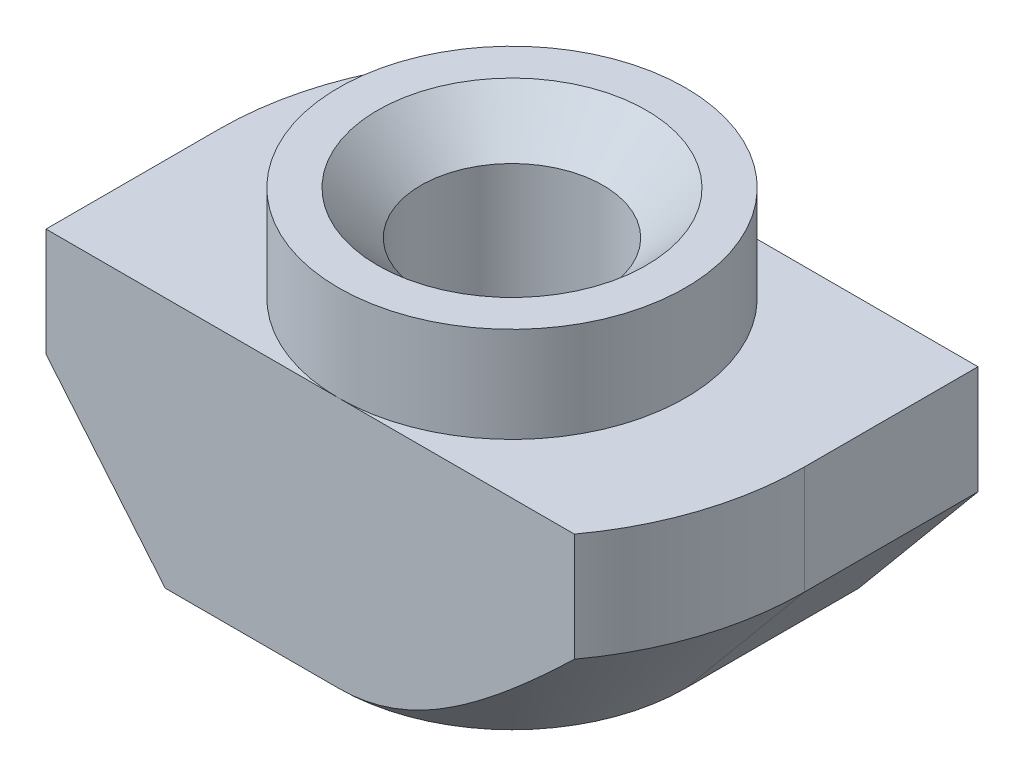
ISO-10303-21;
HEADER;
FILE_DESCRIPTION(('STEP AP214'),'2;1');
FILE_NAME('part.step','',(''),(''),'','','');
FILE_SCHEMA(('AUTOMOTIVE_DESIGN { 1 0 10303 214 1 1 1 1 }'));
ENDSEC;
DATA;
#1=APPLICATION_CONTEXT('core data for automotive mechanical design processes');
#2=APPLICATION_PROTOCOL_DEFINITION('international standard','automotive_design',2000,#1);
#3=PRODUCT_CONTEXT('',#1,'mechanical');
#4=PRODUCT('Part','Part','',(#3));
#5=PRODUCT_RELATED_PRODUCT_CATEGORY('part','',(#4));
#6=PRODUCT_DEFINITION_FORMATION('','',#4);
#7=PRODUCT_DEFINITION_CONTEXT('part definition',#1,'design');
#8=PRODUCT_DEFINITION('design','',#6,#7);
#9=PRODUCT_DEFINITION_SHAPE('','',#8);
#10=(LENGTH_UNIT() NAMED_UNIT(*) SI_UNIT(.MILLI.,.METRE.));
#11=(NAMED_UNIT(*) PLANE_ANGLE_UNIT() SI_UNIT($,.RADIAN.));
#12=(NAMED_UNIT(*) SI_UNIT($,.STERADIAN.) SOLID_ANGLE_UNIT());
#13=UNCERTAINTY_MEASURE_WITH_UNIT(LENGTH_MEASURE(1.E-05),#10,'distance_accuracy_value','');
#14=(GEOMETRIC_REPRESENTATION_CONTEXT(3) GLOBAL_UNCERTAINTY_ASSIGNED_CONTEXT((#13)) GLOBAL_UNIT_ASSIGNED_CONTEXT((#10,
#11,#12)) REPRESENTATION_CONTEXT('',''));
#15=CARTESIAN_POINT('',(0.,0.,0.));
#16=DIRECTION('',(0.,0.,1.));
#17=DIRECTION('',(1.,0.,0.));
#18=AXIS2_PLACEMENT_3D('',#15,#16,#17);
#19=CARTESIAN_POINT('',(-6.75,-2.2,4.));
#20=DIRECTION('',(1.,0.,0.));
#21=DIRECTION('',(0.,1.,0.));
#22=AXIS2_PLACEMENT_3D('',#19,#20,#21);
#23=PLANE('',#22);
#24=DIRECTION('',(0.,0.,-1.));
#25=VECTOR('',#24,1.);
#26=CARTESIAN_POINT('',(-6.75,-4.7,4.));
#27=LINE('',#26,#25);
#28=CARTESIAN_POINT('',(-6.75,-4.7,4.));
#29=VERTEX_POINT('',#28);
#30=CARTESIAN_POINT('',(-6.75,-4.7,0.));
#31=VERTEX_POINT('',#30);
#32=EDGE_CURVE('E205',#29,#31,#27,.T.);
#33=ORIENTED_EDGE('',*,*,#32,.F.);
#34=DIRECTION('',(0.,-1.,0.));
#35=VECTOR('',#34,1.);
#36=CARTESIAN_POINT('',(-6.75,-2.2,4.));
#37=LINE('',#36,#35);
#38=CARTESIAN_POINT('',(-6.75,-2.2,4.));
#39=VERTEX_POINT('',#38);
#40=EDGE_CURVE('E134',#39,#29,#37,.T.);
#41=ORIENTED_EDGE('',*,*,#40,.F.);
#42=DIRECTION('',(0.,0.,-1.));
#43=VECTOR('',#42,1.);
#44=CARTESIAN_POINT('',(-6.75,-2.2,4.));
#45=LINE('',#44,#43);
#46=CARTESIAN_POINT('',(-6.75,-2.2,0.));
#47=VERTEX_POINT('',#46);
#48=EDGE_CURVE('E12',#39,#47,#45,.T.);
#49=ORIENTED_EDGE('',*,*,#48,.T.);
#50=DIRECTION('',(0.,1.,0.));
#51=VECTOR('',#50,1.);
#52=CARTESIAN_POINT('',(-6.75,-8.,0.));
#53=LINE('',#52,#51);
#54=EDGE_CURVE('E206',#31,#47,#53,.T.);
#55=ORIENTED_EDGE('',*,*,#54,.F.);
#56=EDGE_LOOP('',(#33,#41,#49,#55));
#57=FACE_BOUND('',#56,.T.);
#58=ADVANCED_FACE('F38',(#57),#23,.F.);
#59=CARTESIAN_POINT('',(-6.75,-8.,4.));
#60=DIRECTION('',(0.,1.,0.));
#61=DIRECTION('',(0.,0.,1.));
#62=AXIS2_PLACEMENT_3D('',#59,#60,#61);
#63=PLANE('',#62);
#64=CARTESIAN_POINT('',(0.,-8.,0.));
#65=DIRECTION('',(0.,1.,0.));
#66=DIRECTION('',(0.,0.,1.));
#67=AXIS2_PLACEMENT_3D('',#64,#65,#66);
#68=CIRCLE('',#67,3.1);
#69=CARTESIAN_POINT('',(0.,-8.,3.1));
#70=VERTEX_POINT('',#69);
#71=EDGE_CURVE('E186',#70,#70,#68,.T.);
#72=ORIENTED_EDGE('',*,*,#71,.T.);
#73=EDGE_LOOP('',(#72));
#74=FACE_BOUND('',#73,.T.);
#75=DIRECTION('',(1.,0.,0.));
#76=VECTOR('',#75,1.);
#77=CARTESIAN_POINT('',(-6.75,-8.,4.));
#78=LINE('',#77,#76);
#79=CARTESIAN_POINT('',(-4.,-8.,4.));
#80=VERTEX_POINT('',#79);
#81=CARTESIAN_POINT('',(0.,-8.,4.));
#82=VERTEX_POINT('',#81);
#83=EDGE_CURVE('E132',#80,#82,#78,.T.);
#84=ORIENTED_EDGE('',*,*,#83,.F.);
#85=DIRECTION('',(0.,0.,-1.));
#86=VECTOR('',#85,1.);
#87=CARTESIAN_POINT('',(-4.,-8.,4.));
#88=LINE('',#87,#86);
#89=CARTESIAN_POINT('',(-4.,-8.,0.));
#90=VERTEX_POINT('',#89);
#91=EDGE_CURVE('E117',#80,#90,#88,.T.);
#92=ORIENTED_EDGE('',*,*,#91,.T.);
#93=CARTESIAN_POINT('',(0.,-8.,0.));
#94=DIRECTION('',(0.,-1.,0.));
#95=DIRECTION('',(-1.,0.,0.));
#96=AXIS2_PLACEMENT_3D('',#93,#94,#95);
#97=CIRCLE('',#96,4.);
#98=CARTESIAN_POINT('',(0.,-8.,-4.));
#99=VERTEX_POINT('',#98);
#100=EDGE_CURVE('E207',#90,#99,#97,.T.);
#101=ORIENTED_EDGE('',*,*,#100,.T.);
#102=DIRECTION('',(1.,0.,0.));
#103=VECTOR('',#102,1.);
#104=CARTESIAN_POINT('',(-6.75,-8.,-4.));
#105=LINE('',#104,#103);
#106=CARTESIAN_POINT('',(4.,-8.,-4.));
#107=VERTEX_POINT('',#106);
#108=EDGE_CURVE('E149',#99,#107,#105,.T.);
#109=ORIENTED_EDGE('',*,*,#108,.T.);
#110=DIRECTION('',(0.,0.,1.));
#111=VECTOR('',#110,1.);
#112=CARTESIAN_POINT('',(4.,-8.,-6.75));
#113=LINE('',#112,#111);
#114=CARTESIAN_POINT('',(4.,-8.,0.));
#115=VERTEX_POINT('',#114);
#116=EDGE_CURVE('E53',#107,#115,#113,.T.);
#117=ORIENTED_EDGE('',*,*,#116,.T.);
#118=CARTESIAN_POINT('',(0.,-8.,0.));
#119=DIRECTION('',(0.,-1.,0.));
#120=DIRECTION('',(1.,0.,0.));
#121=AXIS2_PLACEMENT_3D('',#118,#119,#120);
#122=CIRCLE('',#121,4.);
#123=EDGE_CURVE('E138',#115,#82,#122,.T.);
#124=ORIENTED_EDGE('',*,*,#123,.T.);
#125=EDGE_LOOP('',(#84,#92,#101,#109,#117,#124));
#126=FACE_BOUND('',#125,.T.);
#127=ADVANCED_FACE('F137',(#74,#126),#63,.F.);
#128=CARTESIAN_POINT('',(6.75,-2.2,4.));
#129=DIRECTION('',(-1.,0.,0.));
#130=DIRECTION('',(0.,-1.,0.));
#131=AXIS2_PLACEMENT_3D('',#128,#129,#130);
#132=PLANE('',#131);
#133=DIRECTION('',(0.,0.,1.));
#134=VECTOR('',#133,1.);
#135=CARTESIAN_POINT('',(6.75,-4.7,-6.75));
#136=LINE('',#135,#134);
#137=CARTESIAN_POINT('',(6.75,-4.7,-4.));
#138=VERTEX_POINT('',#137);
#139=CARTESIAN_POINT('',(6.75,-4.7,0.));
#140=VERTEX_POINT('',#139);
#141=EDGE_CURVE('E418',#138,#140,#136,.T.);
#142=ORIENTED_EDGE('',*,*,#141,.F.);
#143=DIRECTION('',(0.,1.,0.));
#144=VECTOR('',#143,1.);
#145=CARTESIAN_POINT('',(6.75,-2.2,-4.));
#146=LINE('',#145,#144);
#147=CARTESIAN_POINT('',(6.75,-2.2,-4.));
#148=VERTEX_POINT('',#147);
#149=EDGE_CURVE('E153',#138,#148,#146,.T.);
#150=ORIENTED_EDGE('',*,*,#149,.T.);
#151=DIRECTION('',(0.,0.,-1.));
#152=VECTOR('',#151,1.);
#153=CARTESIAN_POINT('',(6.75,-2.2,4.));
#154=LINE('',#153,#152);
#155=CARTESIAN_POINT('',(6.75,-2.2,0.));
#156=VERTEX_POINT('',#155);
#157=EDGE_CURVE('E46',#156,#148,#154,.T.);
#158=ORIENTED_EDGE('',*,*,#157,.F.);
#159=DIRECTION('',(0.,1.,0.));
#160=VECTOR('',#159,1.);
#161=CARTESIAN_POINT('',(6.75,-8.,0.));
#162=LINE('',#161,#160);
#163=EDGE_CURVE('E414',#140,#156,#162,.T.);
#164=ORIENTED_EDGE('',*,*,#163,.F.);
#165=EDGE_LOOP('',(#142,#150,#158,#164));
#166=FACE_BOUND('',#165,.T.);
#167=ADVANCED_FACE('F279',(#166),#132,.F.);
#168=CARTESIAN_POINT('',(0.,0.,4.));
#169=DIRECTION('',(0.,0.,-1.));
#170=DIRECTION('',(-1.,0.,0.));
#171=AXIS2_PLACEMENT_3D('',#168,#169,#170);
#172=PLANE('',#171);
#173=DIRECTION('',(-0.64018439966448,0.768221279597376,0.));
#174=VECTOR('',#173,1.);
#175=CARTESIAN_POINT('',(-4.,-8.,4.));
#176=LINE('',#175,#174);
#177=EDGE_CURVE('E120',#80,#29,#176,.T.);
#178=ORIENTED_EDGE('',*,*,#177,.F.);
#179=ORIENTED_EDGE('',*,*,#83,.T.);
#180=CARTESIAN_POINT('',(11.3671058523787,1.6604279833352,4.));
#181=CARTESIAN_POINT('',(11.0760860403435,1.33105236329668,4.));
#182=CARTESIAN_POINT('',(10.7844170425921,1.0022457486954,4.));
#183=CARTESIAN_POINT('',(10.1993231212537,0.346167668803112,4.));
#184=CARTESIAN_POINT('',(9.90589810454392,0.0188962865979481,4.));
#185=CARTESIAN_POINT('',(9.31636959174981,-0.634228413028052,4.));
#186=CARTESIAN_POINT('',(9.02026241673751,-0.960078413617772,4.));
#187=CARTESIAN_POINT('',(8.42520423771567,-1.60916385316204,4.));
#188=CARTESIAN_POINT('',(8.12625329733044,-1.93239935031355,4.));
#189=CARTESIAN_POINT('',(7.62113759930271,-2.4721099891261,4.));
#190=CARTESIAN_POINT('',(7.41599765243581,-2.68954364333778,4.));
#191=CARTESIAN_POINT('',(7.00354639223159,-3.12234172549854,4.));
#192=CARTESIAN_POINT('',(6.79623509747719,-3.3377061711262,4.));
#193=CARTESIAN_POINT('',(6.37905836666979,-3.76561209058286,4.));
#194=CARTESIAN_POINT('',(6.16919513057166,-3.97815570550829,4.));
#195=CARTESIAN_POINT('',(5.74601037812939,-4.39976961895935,4.));
#196=CARTESIAN_POINT('',(5.53268898786923,-4.60884004355697,4.));
#197=CARTESIAN_POINT('',(5.15124375070127,-4.97462048091292,4.));
#198=CARTESIAN_POINT('',(4.98403986804425,-5.13228814267081,4.));
#199=CARTESIAN_POINT('',(4.64631811321141,-5.44402840167018,4.));
#200=CARTESIAN_POINT('',(4.47580042417569,-5.598101196555,4.));
#201=CARTESIAN_POINT('',(4.13017207023597,-5.90188540217576,4.));
#202=CARTESIAN_POINT('',(3.95505126633798,-6.05158532538534,4.));
#203=CARTESIAN_POINT('',(3.59949530306292,-6.34453303438679,4.));
#204=CARTESIAN_POINT('',(3.41906102603611,-6.48778188155665,4.));
#205=CARTESIAN_POINT('',(3.08710238276612,-6.7382816415291,4.));
#206=CARTESIAN_POINT('',(2.9367791889699,-6.84711583647144,4.));
#207=CARTESIAN_POINT('',(2.63062968508205,-7.05697462965617,4.));
#208=CARTESIAN_POINT('',(2.47480119221121,-7.15799607845374,4.));
#209=CARTESIAN_POINT('',(2.15713415120621,-7.3489904492666,4.));
#210=CARTESIAN_POINT('',(1.99531682288903,-7.43899827290574,4.));
#211=CARTESIAN_POINT('',(1.66430471093152,-7.60421837809288,4.));
#212=CARTESIAN_POINT('',(1.49511815297165,-7.67944666473227,4.));
#213=CARTESIAN_POINT('',(1.22532028837003,-7.78104788986654,4.));
#214=CARTESIAN_POINT('',(1.1273143533449,-7.81434780581565,4.));
#215=CARTESIAN_POINT('',(0.929111702410566,-7.87355862683957,4.));
#216=CARTESIAN_POINT('',(0.828915970387746,-7.8994727797637,4.));
#217=CARTESIAN_POINT('',(0.626974776585255,-7.94285077714466,4.));
#218=CARTESIAN_POINT('',(0.525234247502404,-7.96033732003277,4.));
#219=CARTESIAN_POINT('',(0.320587377338076,-7.9861557277214,4.));
#220=CARTESIAN_POINT('',(0.217681101494288,-7.99448810227678,4.));
#221=CARTESIAN_POINT('',(0.0109646248512727,-8.00159180517583,4.));
#222=CARTESIAN_POINT('',(-0.0928474297287709,-8.00031009062098,4.));
#223=CARTESIAN_POINT('',(-0.299898814737338,-7.9881281506586,4.));
#224=CARTESIAN_POINT('',(-0.40313813276692,-7.97722771783069,4.));
#225=CARTESIAN_POINT('',(-0.608438421840278,-7.94633009665039,4.));
#226=CARTESIAN_POINT('',(-0.71049665003145,-7.92631491101996,4.));
#227=CARTESIAN_POINT('',(-0.912642818545191,-7.87808415322407,4.));
#228=CARTESIAN_POINT('',(-1.01273044558611,-7.84986728823619,4.));
#229=CARTESIAN_POINT('',(-1.26097022328073,-7.77010282363247,4.));
#230=CARTESIAN_POINT('',(-1.40765516117371,-7.71399045924579,4.));
#231=CARTESIAN_POINT('',(-1.69551109235078,-7.58908365745236,4.));
#232=CARTESIAN_POINT('',(-1.83667800442798,-7.52028004074414,4.));
#233=CARTESIAN_POINT('',(-2.11511367892286,-7.37234003071119,4.));
#234=CARTESIAN_POINT('',(-2.2523340884189,-7.29311364527057,4.));
#235=CARTESIAN_POINT('',(-2.52208605930552,-7.12722060395302,4.));
#236=CARTESIAN_POINT('',(-2.6546191958479,-7.04055648171835,4.));
#237=CARTESIAN_POINT('',(-2.95400047597727,-6.83527687212387,4.));
#238=CARTESIAN_POINT('',(-3.11952436318278,-6.7147399741869,4.));
#239=CARTESIAN_POINT('',(-3.44531861404335,-6.46672890623101,4.));
#240=CARTESIAN_POINT('',(-3.60558727407307,-6.33925252152669,4.));
#241=CARTESIAN_POINT('',(-3.9221474541375,-6.07893509202181,4.));
#242=CARTESIAN_POINT('',(-4.07843167821133,-5.94608521765208,4.));
#243=CARTESIAN_POINT('',(-4.38757291443555,-5.67645232979501,4.));
#244=CARTESIAN_POINT('',(-4.54042969785064,-5.53966905518858,4.));
#245=CARTESIAN_POINT('',(-4.83522877775952,-5.27046150562527,4.));
#246=CARTESIAN_POINT('',(-4.97731697077144,-5.1381965019456,4.));
#247=CARTESIAN_POINT('',(-5.25941894431438,-4.87146361855921,4.));
#248=CARTESIAN_POINT('',(-5.39943262931632,-4.73699563800422,4.));
#249=CARTESIAN_POINT('',(-5.67711404789033,-4.46686346687586,4.));
#250=CARTESIAN_POINT('',(-5.81478933960528,-4.33120702987574,4.));
#251=CARTESIAN_POINT('',(-6.08865443408717,-4.05843440191746,4.));
#252=CARTESIAN_POINT('',(-6.224844412109,-3.92131838703406,4.));
#253=CARTESIAN_POINT('',(-6.36042798333519,-3.78361139097708,4.));
#254=B_SPLINE_CURVE_WITH_KNOTS('',3,(#180,#181,#182,#183,#184,#185,#186,#187,#188,#189,#190,
#191,#192,#193,#194,#195,#196,#197,#198,#199,#200,#201,#202,#203,#204,#205,#206,#207,#208,#209,
#210,#211,#212,#213,#214,#215,#216,#217,#218,#219,#220,#221,#222,#223,#224,#225,#226,#227,#228,
#229,#230,#231,#232,#233,#234,#235,#236,#237,#238,#239,#240,#241,#242,#243,#244,#245,#246,#247,
#248,#249,#250,#251,#252,#253),.UNSPECIFIED.,.F.,.F.,(4,2,2,2,2,2,2,2,2,2,2,2,2,2,2,2,2,2,2,2,2,
2,2,2,2,2,2,2,2,2,2,2,2,2,2,2,4),(0.,1.31857462633975,2.63721980838195,3.95808596325466,
5.2789226352314,6.17570450954513,7.07247871524691,7.96852805964379,8.86454480731277,
9.55395925437611,10.2433357081569,10.9343845914659,11.6253193598719,12.1818961728885,
12.7386961940615,13.2936833492167,13.8480661428148,14.1583551805519,14.4685075590911,
14.7778198572062,15.0871149302236,15.398117697584,15.7091271716476,16.0207534213141,
16.3324288189748,16.8027542480267,17.2734211964924,17.7484574522495,18.223332525822,
18.8373538413049,19.4515722792289,20.066844614587,20.6821578895728,21.2644939095022,
21.846856662618,22.4266847622442,23.006443690165),.UNSPECIFIED.);
#255=CARTESIAN_POINT('',(5.43714079273289,-4.7,4.));
#256=VERTEX_POINT('',#255);
#257=EDGE_CURVE('E216',#256,#82,#254,.T.);
#258=ORIENTED_EDGE('',*,*,#257,.F.);
#259=DIRECTION('',(0.,1.,0.));
#260=VECTOR('',#259,1.);
#261=CARTESIAN_POINT('',(5.43714079273289,-8.,4.));
#262=LINE('',#261,#260);
#263=CARTESIAN_POINT('',(5.43714079273289,-2.2,4.));
#264=VERTEX_POINT('',#263);
#265=EDGE_CURVE('E413',#256,#264,#262,.T.);
#266=ORIENTED_EDGE('',*,*,#265,.T.);
#267=DIRECTION('',(-1.,0.,0.));
#268=VECTOR('',#267,1.);
#269=CARTESIAN_POINT('',(4.,-2.2,4.));
#270=LINE('',#269,#268);
#271=CARTESIAN_POINT('',(0.,-2.2,4.));
#272=VERTEX_POINT('',#271);
#273=EDGE_CURVE('E139',#264,#272,#270,.T.);
#274=ORIENTED_EDGE('',*,*,#273,.T.);
#275=DIRECTION('',(-1.,0.,0.));
#276=VECTOR('',#275,1.);
#277=CARTESIAN_POINT('',(-4.,-2.2,4.));
#278=LINE('',#277,#276);
#279=EDGE_CURVE('E142',#272,#39,#278,.T.);
#280=ORIENTED_EDGE('',*,*,#279,.T.);
#281=ORIENTED_EDGE('',*,*,#40,.T.);
#282=EDGE_LOOP('',(#178,#179,#258,#266,#274,#280,#281));
#283=FACE_BOUND('',#282,.T.);
#284=ADVANCED_FACE('F130',(#283),#172,.F.);
#285=CARTESIAN_POINT('',(0.,0.,-4.));
#286=DIRECTION('',(0.,0.,-1.));
#287=DIRECTION('',(-1.,0.,0.));
#288=AXIS2_PLACEMENT_3D('',#285,#286,#287);
#289=PLANE('',#288);
#290=ORIENTED_EDGE('',*,*,#108,.F.);
#291=CARTESIAN_POINT('',(6.36042798333519,-3.78361139097707,-4.));
#292=CARTESIAN_POINT('',(6.19096575336858,-3.95569840243713,-4.));
#293=CARTESIAN_POINT('',(6.02057434282416,-4.12688678135177,-4.));
#294=CARTESIAN_POINT('',(5.67733276321281,-4.46690600025116,-4.));
#295=CARTESIAN_POINT('',(5.50448170584883,-4.63573594250527,-4.));
#296=CARTESIAN_POINT('',(5.15343455302278,-4.972663262347,-4.));
#297=CARTESIAN_POINT('',(4.9751975969079,-5.14071821849171,-4.));
#298=CARTESIAN_POINT('',(4.6149498607722,-5.47268321242632,-4.));
#299=CARTESIAN_POINT('',(4.43293975985162,-5.63659398450987,-4.));
#300=CARTESIAN_POINT('',(4.06675827990445,-5.95652898831325,-4.));
#301=CARTESIAN_POINT('',(3.88265752383698,-6.11263353638464,-4.));
#302=CARTESIAN_POINT('',(3.50828453614381,-6.41749747866301,-4.));
#303=CARTESIAN_POINT('',(3.31800926609262,-6.56625316287942,-4.));
#304=CARTESIAN_POINT('',(2.93035124990496,-6.85259362520673,-4.));
#305=CARTESIAN_POINT('',(2.73300275139348,-6.99022387683537,-4.));
#306=CARTESIAN_POINT('',(2.42953473468976,-7.18489735123375,-4.));
#307=CARTESIAN_POINT('',(2.32717967179717,-7.24780404036723,-4.));
#308=CARTESIAN_POINT('',(2.11966414757884,-7.36879189976334,-4.));
#309=CARTESIAN_POINT('',(2.01450430910475,-7.4268741297905,-4.));
#310=CARTESIAN_POINT('',(1.80835156000338,-7.53336911111571,-4.));
#311=CARTESIAN_POINT('',(1.70756069861796,-7.58217066418254,-4.));
#312=CARTESIAN_POINT('',(1.50316245831686,-7.67352703006457,-4.));
#313=CARTESIAN_POINT('',(1.39955510653057,-7.7160819030247,-4.));
#314=CARTESIAN_POINT('',(1.18972908518557,-7.79360961328778,-4.));
#315=CARTESIAN_POINT('',(1.08351559358896,-7.82859631293787,-4.));
#316=CARTESIAN_POINT('',(0.868583618519514,-7.88973401493709,-4.));
#317=CARTESIAN_POINT('',(0.759866032508893,-7.91588813180793,-4.));
#318=CARTESIAN_POINT('',(0.538694027528681,-7.95846494602781,-4.));
#319=CARTESIAN_POINT('',(0.426207628128944,-7.9747242726588,-4.));
#320=CARTESIAN_POINT('',(0.200169904733209,-7.99589452771145,-4.));
#321=CARTESIAN_POINT('',(0.0866187330024983,-8.00080705463661,-4.));
#322=CARTESIAN_POINT('',(-0.14030246546195,-7.99897680276572,-4.));
#323=CARTESIAN_POINT('',(-0.253672564281047,-7.99224288233528,-4.));
#324=CARTESIAN_POINT('',(-0.479183052625283,-7.96756047116108,-4.));
#325=CARTESIAN_POINT('',(-0.591323194273916,-7.94960976064056,-4.));
#326=CARTESIAN_POINT('',(-0.828679638026792,-7.90034905554965,-4.));
#327=CARTESIAN_POINT('',(-0.953583231400814,-7.86754605043562,-4.));
#328=CARTESIAN_POINT('',(-1.19986914543705,-7.79073406538926,-4.));
#329=CARTESIAN_POINT('',(-1.3212503989237,-7.74672172800898,-4.));
#330=CARTESIAN_POINT('',(-1.56082541702524,-7.64930064968035,-4.));
#331=CARTESIAN_POINT('',(-1.67900070300678,-7.59584703461212,-4.));
#332=CARTESIAN_POINT('',(-1.91163789661902,-7.48153602858787,-4.));
#333=CARTESIAN_POINT('',(-2.02610074298846,-7.42068052807702,-4.));
#334=CARTESIAN_POINT('',(-2.24982698084,-7.29408545468892,-4.));
#335=CARTESIAN_POINT('',(-2.35914453198821,-7.2284408283964,-4.));
#336=CARTESIAN_POINT('',(-2.57488733972282,-7.09253769210792,-4.));
#337=CARTESIAN_POINT('',(-2.68131199183111,-7.02227822815051,-4.));
#338=CARTESIAN_POINT('',(-2.89169764431045,-6.87797184251119,-4.));
#339=CARTESIAN_POINT('',(-2.99565622808834,-6.80392141347488,-4.));
#340=CARTESIAN_POINT('',(-3.2013375457822,-6.65277039463402,-4.));
#341=CARTESIAN_POINT('',(-3.3030600621233,-6.57566951003837,-4.));
#342=CARTESIAN_POINT('',(-3.60604350367824,-6.34006161951297,-4.));
#343=CARTESIAN_POINT('',(-3.80436678812835,-6.17777759521849,-4.));
#344=CARTESIAN_POINT('',(-4.19495816162702,-5.8463449975692,-4.));
#345=CARTESIAN_POINT('',(-4.38722911257422,-5.67719975790317,-4.));
#346=CARTESIAN_POINT('',(-4.76932607132929,-5.33194003602518,-4.));
#347=CARTESIAN_POINT('',(-4.95910052151099,-5.15576868961153,-4.));
#348=CARTESIAN_POINT('',(-5.33502188706818,-4.79957417522254,-4.));
#349=CARTESIAN_POINT('',(-5.52116842133824,-4.61955060670181,-4.));
#350=CARTESIAN_POINT('',(-5.89016183920031,-4.25697547690541,-4.));
#351=CARTESIAN_POINT('',(-6.07301515093437,-4.07443044237156,-4.));
#352=CARTESIAN_POINT('',(-6.43641169237051,-3.7070540660433,-4.));
#353=CARTESIAN_POINT('',(-6.61695488536694,-3.52222268801255,-4.));
#354=CARTESIAN_POINT('',(-6.99538489166774,-3.13085659403494,-4.));
#355=CARTESIAN_POINT('',(-7.19305928569326,-2.92411671759019,-4.));
#356=CARTESIAN_POINT('',(-7.58653956245801,-2.50886514282632,-4.));
#357=CARTESIAN_POINT('',(-7.78234542570909,-2.3003534260703,-4.));
#358=CARTESIAN_POINT('',(-8.367762944238,-1.67239202502907,-4.));
#359=CARTESIAN_POINT('',(-8.7550896613572,-1.25081288986206,-4.));
#360=CARTESIAN_POINT('',(-9.51490357897524,-0.415499947766777,-4.));
#361=CARTESIAN_POINT('',(-9.88750555068452,-0.00187016028489452,-4.));
#362=CARTESIAN_POINT('',(-10.4440554129111,0.620367028404783,-4.));
#363=CARTESIAN_POINT('',(-10.6291035911556,0.827991694286216,-4.));
#364=CARTESIAN_POINT('',(-10.9985605428931,1.24380681047688,-4.));
#365=CARTESIAN_POINT('',(-11.1829693205407,1.45199725709403,-4.));
#366=CARTESIAN_POINT('',(-11.3671058523788,1.66042798333522,-4.));
#367=B_SPLINE_CURVE_WITH_KNOTS('',3,(#291,#292,#293,#294,#295,#296,#297,#298,#299,#300,#301,
#302,#303,#304,#305,#306,#307,#308,#309,#310,#311,#312,#313,#314,#315,#316,#317,#318,#319,#320,
#321,#322,#323,#324,#325,#326,#327,#328,#329,#330,#331,#332,#333,#334,#335,#336,#337,#338,#339,
#340,#341,#342,#343,#344,#345,#346,#347,#348,#349,#350,#351,#352,#353,#354,#355,#356,#357,#358,
#359,#360,#361,#362,#363,#364,#365,#366),.UNSPECIFIED.,.F.,.F.,(4,2,2,2,2,2,2,2,2,2,2,2,2,2,2,2,
2,2,2,2,2,2,2,2,2,2,2,2,2,2,2,2,2,2,2,2,2,4),(0.,0.724570694082745,1.44941006424093,
2.18427371550557,2.9190062331236,3.64298504327244,4.3673256871961,5.08853781395851,
5.44885986155676,5.8091025485538,6.14487928433326,6.48065278694036,6.8158059576366,
7.15084082381942,7.49126707240273,7.83164535981976,8.17176486708144,8.51195170453121,
8.89873227102634,9.28562882355322,9.67441635667138,10.0631048009477,10.445504788757,
10.8279840751224,11.2108238573614,11.5937007274213,12.3622116617607,13.1303535669006,
13.9071050075758,14.6839376093844,15.4590392555737,16.2341532021534,17.0922460992291,
17.9503479361577,19.667785634447,21.3378879891101,22.1722473665305,23.0066013122183),.UNSPECIFIED.);
#368=CARTESIAN_POINT('',(-5.43714079273289,-4.7,-4.));
#369=VERTEX_POINT('',#368);
#370=EDGE_CURVE('E224',#99,#369,#367,.T.);
#371=ORIENTED_EDGE('',*,*,#370,.T.);
#372=DIRECTION('',(0.,1.,0.));
#373=VECTOR('',#372,1.);
#374=CARTESIAN_POINT('',(-5.43714079273289,-8.,-4.));
#375=LINE('',#374,#373);
#376=CARTESIAN_POINT('',(-5.43714079273289,-2.2,-4.));
#377=VERTEX_POINT('',#376);
#378=EDGE_CURVE('E176',#369,#377,#375,.T.);
#379=ORIENTED_EDGE('',*,*,#378,.T.);
#380=DIRECTION('',(-1.,0.,0.));
#381=VECTOR('',#380,1.);
#382=CARTESIAN_POINT('',(-4.,-2.2,-4.));
#383=LINE('',#382,#381);
#384=CARTESIAN_POINT('',(0.,-2.2,-4.));
#385=VERTEX_POINT('',#384);
#386=EDGE_CURVE('E146',#385,#377,#383,.T.);
#387=ORIENTED_EDGE('',*,*,#386,.F.);
#388=DIRECTION('',(-1.,0.,0.));
#389=VECTOR('',#388,1.);
#390=CARTESIAN_POINT('',(4.,-2.2,-4.));
#391=LINE('',#390,#389);
#392=EDGE_CURVE('E155',#148,#385,#391,.T.);
#393=ORIENTED_EDGE('',*,*,#392,.F.);
#394=ORIENTED_EDGE('',*,*,#149,.F.);
#395=DIRECTION('',(-0.64018439966448,-0.768221279597376,0.));
#396=VECTOR('',#395,1.);
#397=CARTESIAN_POINT('',(6.29508196721311,-5.24590163934426,-4.));
#398=LINE('',#397,#396);
#399=EDGE_CURVE('E214',#138,#107,#398,.T.);
#400=ORIENTED_EDGE('',*,*,#399,.T.);
#401=EDGE_LOOP('',(#290,#371,#379,#387,#393,#394,#400));
#402=FACE_BOUND('',#401,.T.);
#403=ADVANCED_FACE('F173',(#402),#289,.T.);
#404=CARTESIAN_POINT('',(0.,-8.,0.));
#405=DIRECTION('',(0.,1.,0.));
#406=DIRECTION('',(-1.,0.,0.));
#407=AXIS2_PLACEMENT_3D('',#404,#405,#406);
#408=CYLINDRICAL_SURFACE('',#407,6.75);
#409=CARTESIAN_POINT('',(0.,-4.7,0.));
#410=DIRECTION('',(0.,-1.,0.));
#411=DIRECTION('',(-1.,0.,0.));
#412=AXIS2_PLACEMENT_3D('',#409,#410,#411);
#413=CIRCLE('',#412,6.75);
#414=EDGE_CURVE('E61',#31,#369,#413,.T.);
#415=ORIENTED_EDGE('',*,*,#414,.F.);
#416=ORIENTED_EDGE('',*,*,#54,.T.);
#417=CARTESIAN_POINT('',(0.,-2.2,0.));
#418=DIRECTION('',(0.,-1.,0.));
#419=DIRECTION('',(-1.,0.,0.));
#420=AXIS2_PLACEMENT_3D('',#417,#418,#419);
#421=CIRCLE('',#420,6.75);
#422=EDGE_CURVE('E202',#47,#377,#421,.T.);
#423=ORIENTED_EDGE('',*,*,#422,.T.);
#424=ORIENTED_EDGE('',*,*,#378,.F.);
#425=EDGE_LOOP('',(#415,#416,#423,#424));
#426=FACE_BOUND('',#425,.T.);
#427=ADVANCED_FACE('F247',(#426),#408,.T.);
#428=CARTESIAN_POINT('',(0.,-8.,0.));
#429=DIRECTION('',(0.,1.,0.));
#430=DIRECTION('',(-1.,0.,0.));
#431=AXIS2_PLACEMENT_3D('',#428,#429,#430);
#432=CYLINDRICAL_SURFACE('',#431,6.75);
#433=CARTESIAN_POINT('',(0.,-4.7,0.));
#434=DIRECTION('',(0.,-1.,0.));
#435=DIRECTION('',(1.,0.,0.));
#436=AXIS2_PLACEMENT_3D('',#433,#434,#435);
#437=CIRCLE('',#436,6.75);
#438=EDGE_CURVE('E212',#140,#256,#437,.T.);
#439=ORIENTED_EDGE('',*,*,#438,.F.);
#440=ORIENTED_EDGE('',*,*,#163,.T.);
#441=CARTESIAN_POINT('',(0.,-2.2,0.));
#442=DIRECTION('',(0.,-1.,0.));
#443=DIRECTION('',(1.,0.,0.));
#444=AXIS2_PLACEMENT_3D('',#441,#442,#443);
#445=CIRCLE('',#444,6.75);
#446=EDGE_CURVE('E167',#156,#264,#445,.T.);
#447=ORIENTED_EDGE('',*,*,#446,.T.);
#448=ORIENTED_EDGE('',*,*,#265,.F.);
#449=EDGE_LOOP('',(#439,#440,#447,#448));
#450=FACE_BOUND('',#449,.T.);
#451=ADVANCED_FACE('F250',(#450),#432,.T.);
#452=CARTESIAN_POINT('',(4.,0.,4.));
#453=DIRECTION('',(0.,-1.,0.));
#454=DIRECTION('',(0.,0.,-1.));
#455=AXIS2_PLACEMENT_3D('',#452,#453,#454);
#456=PLANE('',#455);
#457=CARTESIAN_POINT('',(0.,0.,0.));
#458=DIRECTION('',(0.,1.,0.));
#459=DIRECTION('',(0.,0.,1.));
#460=AXIS2_PLACEMENT_3D('',#457,#458,#459);
#461=CIRCLE('',#460,3.1);
#462=CARTESIAN_POINT('',(0.,0.,3.1));
#463=VERTEX_POINT('',#462);
#464=EDGE_CURVE('E189',#463,#463,#461,.T.);
#465=ORIENTED_EDGE('',*,*,#464,.F.);
#466=EDGE_LOOP('',(#465));
#467=FACE_BOUND('',#466,.T.);
#468=CARTESIAN_POINT('',(0.,0.,0.));
#469=DIRECTION('',(0.,1.,0.));
#470=DIRECTION('',(0.,0.,1.));
#471=AXIS2_PLACEMENT_3D('',#468,#469,#470);
#472=CIRCLE('',#471,4.);
#473=CARTESIAN_POINT('',(0.,0.,4.));
#474=VERTEX_POINT('',#473);
#475=EDGE_CURVE('E191',#474,#474,#472,.T.);
#476=ORIENTED_EDGE('',*,*,#475,.T.);
#477=EDGE_LOOP('',(#476));
#478=FACE_BOUND('',#477,.T.);
#479=ADVANCED_FACE('F254',(#467,#478),#456,.F.);
#480=CARTESIAN_POINT('',(-4.,-2.2,4.));
#481=DIRECTION('',(0.,-1.,0.));
#482=DIRECTION('',(1.,0.,0.));
#483=AXIS2_PLACEMENT_3D('',#480,#481,#482);
#484=PLANE('',#483);
#485=ORIENTED_EDGE('',*,*,#386,.T.);
#486=ORIENTED_EDGE('',*,*,#422,.F.);
#487=ORIENTED_EDGE('',*,*,#48,.F.);
#488=ORIENTED_EDGE('',*,*,#279,.F.);
#489=CARTESIAN_POINT('',(0.,-2.2,0.));
#490=DIRECTION('',(0.,-1.,0.));
#491=DIRECTION('',(1.,0.,0.));
#492=AXIS2_PLACEMENT_3D('',#489,#490,#491);
#493=CIRCLE('',#492,4.);
#494=EDGE_CURVE('E184',#385,#272,#493,.F.);
#495=ORIENTED_EDGE('',*,*,#494,.F.);
#496=EDGE_LOOP('',(#485,#486,#487,#488,#495));
#497=FACE_BOUND('',#496,.T.);
#498=ADVANCED_FACE('F40',(#497),#484,.F.);
#499=CARTESIAN_POINT('',(4.,-2.2,4.));
#500=DIRECTION('',(0.,-1.,0.));
#501=DIRECTION('',(1.,0.,0.));
#502=AXIS2_PLACEMENT_3D('',#499,#500,#501);
#503=PLANE('',#502);
#504=ORIENTED_EDGE('',*,*,#273,.F.);
#505=ORIENTED_EDGE('',*,*,#446,.F.);
#506=ORIENTED_EDGE('',*,*,#157,.T.);
#507=ORIENTED_EDGE('',*,*,#392,.T.);
#508=EDGE_CURVE('E182',#272,#385,#493,.F.);
#509=ORIENTED_EDGE('',*,*,#508,.F.);
#510=EDGE_LOOP('',(#504,#505,#506,#507,#509));
#511=FACE_BOUND('',#510,.T.);
#512=ADVANCED_FACE('F163',(#511),#503,.F.);
#513=CARTESIAN_POINT('',(0.,-7.,0.));
#514=DIRECTION('',(0.,-1.,0.));
#515=DIRECTION('',(0.,0.,-1.));
#516=AXIS2_PLACEMENT_3D('',#513,#514,#515);
#517=CONICAL_SURFACE('',#516,2.1,0.785398163397447);
#518=ORIENTED_EDGE('',*,*,#71,.F.);
#519=EDGE_LOOP('',(#518));
#520=FACE_BOUND('',#519,.T.);
#521=CARTESIAN_POINT('',(0.,-7.,0.));
#522=DIRECTION('',(0.,1.,0.));
#523=DIRECTION('',(0.,0.,1.));
#524=AXIS2_PLACEMENT_3D('',#521,#522,#523);
#525=CIRCLE('',#524,2.1);
#526=CARTESIAN_POINT('',(0.,-7.,2.1));
#527=VERTEX_POINT('',#526);
#528=EDGE_CURVE('E150',#527,#527,#525,.T.);
#529=ORIENTED_EDGE('',*,*,#528,.T.);
#530=EDGE_LOOP('',(#529));
#531=FACE_BOUND('',#530,.T.);
#532=ADVANCED_FACE('F265',(#520,#531),#517,.F.);
#533=CARTESIAN_POINT('',(0.,0.,0.));
#534=DIRECTION('',(0.,1.,0.));
#535=DIRECTION('',(0.,0.,1.));
#536=AXIS2_PLACEMENT_3D('',#533,#534,#535);
#537=CYLINDRICAL_SURFACE('',#536,2.1);
#538=ORIENTED_EDGE('',*,*,#528,.F.);
#539=EDGE_LOOP('',(#538));
#540=FACE_BOUND('',#539,.T.);
#541=CARTESIAN_POINT('',(0.,-0.999999999999999,0.));
#542=DIRECTION('',(0.,1.,0.));
#543=DIRECTION('',(0.,0.,1.));
#544=AXIS2_PLACEMENT_3D('',#541,#542,#543);
#545=CIRCLE('',#544,2.1);
#546=CARTESIAN_POINT('',(0.,-0.999999999999999,2.1));
#547=VERTEX_POINT('',#546);
#548=EDGE_CURVE('E197',#547,#547,#545,.T.);
#549=ORIENTED_EDGE('',*,*,#548,.T.);
#550=EDGE_LOOP('',(#549));
#551=FACE_BOUND('',#550,.T.);
#552=ADVANCED_FACE('F262',(#540,#551),#537,.F.);
#553=CARTESIAN_POINT('',(0.,0.,0.));
#554=DIRECTION('',(0.,1.,0.));
#555=DIRECTION('',(0.,0.,1.));
#556=AXIS2_PLACEMENT_3D('',#553,#554,#555);
#557=CONICAL_SURFACE('',#556,3.1,0.785398163397449);
#558=ORIENTED_EDGE('',*,*,#548,.F.);
#559=EDGE_LOOP('',(#558));
#560=FACE_BOUND('',#559,.T.);
#561=ORIENTED_EDGE('',*,*,#464,.T.);
#562=EDGE_LOOP('',(#561));
#563=FACE_BOUND('',#562,.T.);
#564=ADVANCED_FACE('F258',(#560,#563),#557,.F.);
#565=CARTESIAN_POINT('',(0.,-18.0594837557847,0.));
#566=DIRECTION('',(0.,1.,0.));
#567=DIRECTION('',(0.,0.,1.));
#568=AXIS2_PLACEMENT_3D('',#565,#566,#567);
#569=CYLINDRICAL_SURFACE('',#568,4.);
#570=ORIENTED_EDGE('',*,*,#475,.F.);
#571=EDGE_LOOP('',(#570));
#572=FACE_BOUND('',#571,.T.);
#573=ORIENTED_EDGE('',*,*,#508,.T.);
#574=ORIENTED_EDGE('',*,*,#494,.T.);
#575=EDGE_LOOP('',(#573,#574));
#576=FACE_BOUND('',#575,.T.);
#577=ADVANCED_FACE('F183',(#572,#576),#569,.T.);
#578=CARTESIAN_POINT('',(4.,-8.,-6.75));
#579=DIRECTION('',(0.768221279597376,-0.64018439966448,0.));
#580=DIRECTION('',(0.64018439966448,0.768221279597376,0.));
#581=AXIS2_PLACEMENT_3D('',#578,#579,#580);
#582=PLANE('',#581);
#583=ORIENTED_EDGE('',*,*,#141,.T.);
#584=DIRECTION('',(0.64018439966448,0.768221279597376,0.));
#585=VECTOR('',#584,1.);
#586=CARTESIAN_POINT('',(4.,-8.,0.));
#587=LINE('',#586,#585);
#588=EDGE_CURVE('E420',#115,#140,#587,.T.);
#589=ORIENTED_EDGE('',*,*,#588,.F.);
#590=ORIENTED_EDGE('',*,*,#116,.F.);
#591=ORIENTED_EDGE('',*,*,#399,.F.);
#592=EDGE_LOOP('',(#583,#589,#590,#591));
#593=FACE_BOUND('',#592,.T.);
#594=ADVANCED_FACE('F238',(#593),#582,.T.);
#595=CARTESIAN_POINT('',(0.,-8.,0.));
#596=DIRECTION('',(0.,1.,0.));
#597=DIRECTION('',(0.,0.,1.));
#598=AXIS2_PLACEMENT_3D('',#595,#596,#597);
#599=CONICAL_SURFACE('',#598,4.,0.694738276196703);
#600=ORIENTED_EDGE('',*,*,#257,.T.);
#601=ORIENTED_EDGE('',*,*,#123,.F.);
#602=ORIENTED_EDGE('',*,*,#588,.T.);
#603=ORIENTED_EDGE('',*,*,#438,.T.);
#604=EDGE_LOOP('',(#600,#601,#602,#603));
#605=FACE_BOUND('',#604,.T.);
#606=ADVANCED_FACE('F234',(#605),#599,.T.);
#607=CARTESIAN_POINT('',(-4.,-8.,4.));
#608=DIRECTION('',(-0.768221279597376,-0.64018439966448,0.));
#609=DIRECTION('',(0.64018439966448,-0.768221279597376,0.));
#610=AXIS2_PLACEMENT_3D('',#607,#608,#609);
#611=PLANE('',#610);
#612=ORIENTED_EDGE('',*,*,#32,.T.);
#613=DIRECTION('',(-0.64018439966448,0.768221279597376,0.));
#614=VECTOR('',#613,1.);
#615=CARTESIAN_POINT('',(-4.,-8.,0.));
#616=LINE('',#615,#614);
#617=EDGE_CURVE('E122',#90,#31,#616,.T.);
#618=ORIENTED_EDGE('',*,*,#617,.F.);
#619=ORIENTED_EDGE('',*,*,#91,.F.);
#620=ORIENTED_EDGE('',*,*,#177,.T.);
#621=EDGE_LOOP('',(#612,#618,#619,#620));
#622=FACE_BOUND('',#621,.T.);
#623=ADVANCED_FACE('F119',(#622),#611,.T.);
#624=CARTESIAN_POINT('',(0.,-8.,0.));
#625=DIRECTION('',(0.,1.,0.));
#626=DIRECTION('',(0.,0.,1.));
#627=AXIS2_PLACEMENT_3D('',#624,#625,#626);
#628=CONICAL_SURFACE('',#627,4.,0.694738276196703);
#629=ORIENTED_EDGE('',*,*,#100,.F.);
#630=ORIENTED_EDGE('',*,*,#617,.T.);
#631=ORIENTED_EDGE('',*,*,#414,.T.);
#632=ORIENTED_EDGE('',*,*,#370,.F.);
#633=EDGE_LOOP('',(#629,#630,#631,#632));
#634=FACE_BOUND('',#633,.T.);
#635=ADVANCED_FACE('F240',(#634),#628,.T.);
#636=CLOSED_SHELL('',(#58,#127,#167,#284,#403,#427,#451,#479,#498,#512,#532,#552,#564,#577,#594,
#606,#623,#635));
#637=MANIFOLD_SOLID_BREP('B2',#636);
#638=ADVANCED_BREP_SHAPE_REPRESENTATION('',(#18,#637),#14);
#639=SHAPE_DEFINITION_REPRESENTATION(#9,#638);
ENDSEC;
END-ISO-10303-21;
